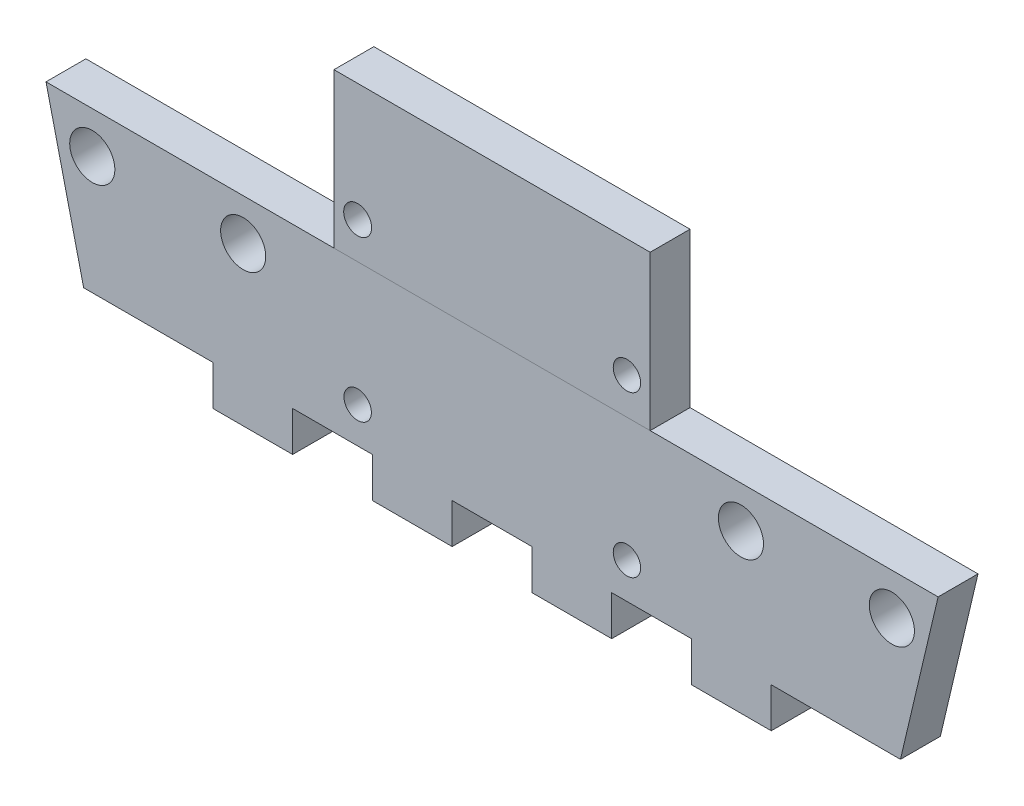
ISO-10303-21;
HEADER;
FILE_DESCRIPTION(('STEP AP214'),'2;1');
FILE_NAME('part.step','',(''),(''),'','','');
FILE_SCHEMA(('AUTOMOTIVE_DESIGN { 1 0 10303 214 1 1 1 1 }'));
ENDSEC;
DATA;
#1=APPLICATION_CONTEXT('core data for automotive mechanical design processes');
#2=APPLICATION_PROTOCOL_DEFINITION('international standard','automotive_design',2000,#1);
#3=PRODUCT_CONTEXT('',#1,'mechanical');
#4=PRODUCT('Part','Part','',(#3));
#5=PRODUCT_RELATED_PRODUCT_CATEGORY('part','',(#4));
#6=PRODUCT_DEFINITION_FORMATION('','',#4);
#7=PRODUCT_DEFINITION_CONTEXT('part definition',#1,'design');
#8=PRODUCT_DEFINITION('design','',#6,#7);
#9=PRODUCT_DEFINITION_SHAPE('','',#8);
#10=(LENGTH_UNIT() NAMED_UNIT(*) SI_UNIT(.MILLI.,.METRE.));
#11=(NAMED_UNIT(*) PLANE_ANGLE_UNIT() SI_UNIT($,.RADIAN.));
#12=(NAMED_UNIT(*) SI_UNIT($,.STERADIAN.) SOLID_ANGLE_UNIT());
#13=UNCERTAINTY_MEASURE_WITH_UNIT(LENGTH_MEASURE(1.E-05),#10,'distance_accuracy_value','');
#14=(GEOMETRIC_REPRESENTATION_CONTEXT(3) GLOBAL_UNCERTAINTY_ASSIGNED_CONTEXT((#13)) GLOBAL_UNIT_ASSIGNED_CONTEXT((#10,
#11,#12)) REPRESENTATION_CONTEXT('',''));
#15=CARTESIAN_POINT('',(0.,0.,0.));
#16=DIRECTION('',(0.,0.,1.));
#17=DIRECTION('',(1.,0.,0.));
#18=AXIS2_PLACEMENT_3D('',#15,#16,#17);
#19=CARTESIAN_POINT('',(19.9263,12.3,0.));
#20=DIRECTION('',(-1.,0.,0.));
#21=DIRECTION('',(0.,-1.,0.));
#22=AXIS2_PLACEMENT_3D('',#19,#20,#21);
#23=PLANE('',#22);
#24=DIRECTION('',(0.,-1.,0.));
#25=VECTOR('',#24,1.);
#26=CARTESIAN_POINT('',(19.9263,12.3,3.175));
#27=LINE('',#26,#25);
#28=CARTESIAN_POINT('',(19.9263,12.3,3.175));
#29=VERTEX_POINT('',#28);
#30=CARTESIAN_POINT('',(19.9263,0.,3.175));
#31=VERTEX_POINT('',#30);
#32=EDGE_CURVE('E217',#29,#31,#27,.T.);
#33=ORIENTED_EDGE('',*,*,#32,.F.);
#34=DIRECTION('',(0.,0.,1.));
#35=VECTOR('',#34,1.);
#36=CARTESIAN_POINT('',(19.9263,12.3,0.));
#37=LINE('',#36,#35);
#38=CARTESIAN_POINT('',(19.9263,12.3,0.));
#39=VERTEX_POINT('',#38);
#40=EDGE_CURVE('E13',#39,#29,#37,.T.);
#41=ORIENTED_EDGE('',*,*,#40,.F.);
#42=DIRECTION('',(0.,-1.,0.));
#43=VECTOR('',#42,1.);
#44=CARTESIAN_POINT('',(19.9263,12.3,0.));
#45=LINE('',#44,#43);
#46=CARTESIAN_POINT('',(19.9263,0.,0.));
#47=VERTEX_POINT('',#46);
#48=EDGE_CURVE('E210',#39,#47,#45,.T.);
#49=ORIENTED_EDGE('',*,*,#48,.T.);
#50=DIRECTION('',(0.,0.,1.));
#51=VECTOR('',#50,1.);
#52=CARTESIAN_POINT('',(19.9263,0.,0.));
#53=LINE('',#52,#51);
#54=EDGE_CURVE('E155',#47,#31,#53,.T.);
#55=ORIENTED_EDGE('',*,*,#54,.T.);
#56=EDGE_LOOP('',(#33,#41,#49,#55));
#57=FACE_BOUND('',#56,.T.);
#58=ADVANCED_FACE('F152',(#57),#23,.T.);
#59=CARTESIAN_POINT('',(19.9263,12.3,0.));
#60=DIRECTION('',(0.,1.,0.));
#61=DIRECTION('',(-1.,0.,0.));
#62=AXIS2_PLACEMENT_3D('',#59,#60,#61);
#63=PLANE('',#62);
#64=DIRECTION('',(-1.,0.,0.));
#65=VECTOR('',#64,1.);
#66=CARTESIAN_POINT('',(19.9263,12.3,3.175));
#67=LINE('',#66,#65);
#68=CARTESIAN_POINT('',(45.0977,12.3,3.175));
#69=VERTEX_POINT('',#68);
#70=EDGE_CURVE('E212',#69,#29,#67,.T.);
#71=ORIENTED_EDGE('',*,*,#70,.F.);
#72=DIRECTION('',(0.,0.,1.));
#73=VECTOR('',#72,1.);
#74=CARTESIAN_POINT('',(45.0977,12.3,0.));
#75=LINE('',#74,#73);
#76=CARTESIAN_POINT('',(45.0977,12.3,0.));
#77=VERTEX_POINT('',#76);
#78=EDGE_CURVE('E161',#77,#69,#75,.T.);
#79=ORIENTED_EDGE('',*,*,#78,.F.);
#80=DIRECTION('',(-1.,0.,0.));
#81=VECTOR('',#80,1.);
#82=CARTESIAN_POINT('',(19.9263,12.3,0.));
#83=LINE('',#82,#81);
#84=EDGE_CURVE('E207',#77,#39,#83,.T.);
#85=ORIENTED_EDGE('',*,*,#84,.T.);
#86=ORIENTED_EDGE('',*,*,#40,.T.);
#87=EDGE_LOOP('',(#71,#79,#85,#86));
#88=FACE_BOUND('',#87,.T.);
#89=ADVANCED_FACE('F228',(#88),#63,.T.);
#90=CARTESIAN_POINT('',(45.0977,12.3,0.));
#91=DIRECTION('',(1.,0.,0.));
#92=DIRECTION('',(0.,1.,0.));
#93=AXIS2_PLACEMENT_3D('',#90,#91,#92);
#94=PLANE('',#93);
#95=DIRECTION('',(0.,1.,0.));
#96=VECTOR('',#95,1.);
#97=CARTESIAN_POINT('',(45.0977,12.3,3.175));
#98=LINE('',#97,#96);
#99=CARTESIAN_POINT('',(45.0977,0.,3.175));
#100=VERTEX_POINT('',#99);
#101=EDGE_CURVE('E202',#100,#69,#98,.T.);
#102=ORIENTED_EDGE('',*,*,#101,.F.);
#103=DIRECTION('',(0.,0.,1.));
#104=VECTOR('',#103,1.);
#105=CARTESIAN_POINT('',(45.0977,0.,0.));
#106=LINE('',#105,#104);
#107=CARTESIAN_POINT('',(45.0977,0.,0.));
#108=VERTEX_POINT('',#107);
#109=EDGE_CURVE('E197',#108,#100,#106,.T.);
#110=ORIENTED_EDGE('',*,*,#109,.F.);
#111=DIRECTION('',(0.,1.,0.));
#112=VECTOR('',#111,1.);
#113=CARTESIAN_POINT('',(45.0977,12.3,0.));
#114=LINE('',#113,#112);
#115=EDGE_CURVE('E200',#108,#77,#114,.T.);
#116=ORIENTED_EDGE('',*,*,#115,.T.);
#117=ORIENTED_EDGE('',*,*,#78,.T.);
#118=EDGE_LOOP('',(#102,#110,#116,#117));
#119=FACE_BOUND('',#118,.T.);
#120=ADVANCED_FACE('F199',(#119),#94,.T.);
#121=CARTESIAN_POINT('',(19.9263,0.,0.));
#122=DIRECTION('',(0.,-1.,0.));
#123=DIRECTION('',(1.,0.,0.));
#124=AXIS2_PLACEMENT_3D('',#121,#122,#123);
#125=PLANE('',#124);
#126=DIRECTION('',(1.,0.,0.));
#127=VECTOR('',#126,1.);
#128=CARTESIAN_POINT('',(19.9263,0.,3.175));
#129=LINE('',#128,#127);
#130=EDGE_CURVE('E220',#31,#100,#129,.T.);
#131=ORIENTED_EDGE('',*,*,#130,.F.);
#132=ORIENTED_EDGE('',*,*,#54,.F.);
#133=DIRECTION('',(1.,0.,0.));
#134=VECTOR('',#133,1.);
#135=CARTESIAN_POINT('',(19.9263,0.,0.));
#136=LINE('',#135,#134);
#137=EDGE_CURVE('E206',#47,#108,#136,.T.);
#138=ORIENTED_EDGE('',*,*,#137,.T.);
#139=ORIENTED_EDGE('',*,*,#109,.T.);
#140=EDGE_LOOP('',(#131,#132,#138,#139));
#141=FACE_BOUND('',#140,.T.);
#142=ADVANCED_FACE('F209',(#141),#125,.T.);
#143=CARTESIAN_POINT('',(0.,0.,0.));
#144=DIRECTION('',(0.,0.,1.));
#145=DIRECTION('',(1.,0.,0.));
#146=AXIS2_PLACEMENT_3D('',#143,#144,#145);
#147=PLANE('',#146);
#148=CARTESIAN_POINT('',(43.2505698195967,2.902,0.));
#149=DIRECTION('',(0.,0.,-1.));
#150=DIRECTION('',(-1.,0.,0.));
#151=AXIS2_PLACEMENT_3D('',#148,#149,#150);
#152=CIRCLE('',#151,1.0922);
#153=CARTESIAN_POINT('',(42.1583698195967,2.902,0.));
#154=VERTEX_POINT('',#153);
#155=EDGE_CURVE('E263',#154,#154,#152,.T.);
#156=ORIENTED_EDGE('',*,*,#155,.F.);
#157=EDGE_LOOP('',(#156));
#158=FACE_BOUND('',#157,.T.);
#159=CARTESIAN_POINT('',(21.8129698195967,2.902,0.));
#160=DIRECTION('',(0.,0.,-1.));
#161=DIRECTION('',(-1.,0.,0.));
#162=AXIS2_PLACEMENT_3D('',#159,#160,#161);
#163=CIRCLE('',#162,1.11207650638862);
#164=CARTESIAN_POINT('',(20.7008933132081,2.902,0.));
#165=VERTEX_POINT('',#164);
#166=EDGE_CURVE('E268',#165,#165,#163,.T.);
#167=ORIENTED_EDGE('',*,*,#166,.F.);
#168=EDGE_LOOP('',(#167));
#169=FACE_BOUND('',#168,.T.);
#170=ORIENTED_EDGE('',*,*,#48,.F.);
#171=ORIENTED_EDGE('',*,*,#84,.F.);
#172=ORIENTED_EDGE('',*,*,#115,.F.);
#173=ORIENTED_EDGE('',*,*,#137,.F.);
#174=EDGE_LOOP('',(#170,#171,#172,#173));
#175=FACE_BOUND('',#174,.T.);
#176=ADVANCED_FACE('F205',(#158,#169,#175),#147,.F.);
#177=CARTESIAN_POINT('',(0.,0.,3.175));
#178=DIRECTION('',(0.,0.,1.));
#179=DIRECTION('',(1.,0.,0.));
#180=AXIS2_PLACEMENT_3D('',#177,#178,#179);
#181=PLANE('',#180);
#182=CARTESIAN_POINT('',(43.2505698195967,2.902,3.175));
#183=DIRECTION('',(0.,0.,-1.));
#184=DIRECTION('',(-1.,0.,0.));
#185=AXIS2_PLACEMENT_3D('',#182,#183,#184);
#186=CIRCLE('',#185,1.0922);
#187=CARTESIAN_POINT('',(42.1583698195967,2.902,3.175));
#188=VERTEX_POINT('',#187);
#189=EDGE_CURVE('E221',#188,#188,#186,.T.);
#190=ORIENTED_EDGE('',*,*,#189,.T.);
#191=EDGE_LOOP('',(#190));
#192=FACE_BOUND('',#191,.T.);
#193=CARTESIAN_POINT('',(21.8129698195967,2.902,3.175));
#194=DIRECTION('',(0.,0.,-1.));
#195=DIRECTION('',(-1.,0.,0.));
#196=AXIS2_PLACEMENT_3D('',#193,#194,#195);
#197=CIRCLE('',#196,1.11207650638862);
#198=CARTESIAN_POINT('',(20.7008933132081,2.902,3.175));
#199=VERTEX_POINT('',#198);
#200=EDGE_CURVE('E264',#199,#199,#197,.T.);
#201=ORIENTED_EDGE('',*,*,#200,.T.);
#202=EDGE_LOOP('',(#201));
#203=FACE_BOUND('',#202,.T.);
#204=ORIENTED_EDGE('',*,*,#32,.T.);
#205=ORIENTED_EDGE('',*,*,#130,.T.);
#206=ORIENTED_EDGE('',*,*,#101,.T.);
#207=ORIENTED_EDGE('',*,*,#70,.T.);
#208=EDGE_LOOP('',(#204,#205,#206,#207));
#209=FACE_BOUND('',#208,.T.);
#210=ADVANCED_FACE('F227',(#192,#203,#209),#181,.T.);
#211=CARTESIAN_POINT('',(21.8129698195967,2.902,3.175));
#212=DIRECTION('',(0.,0.,-1.));
#213=DIRECTION('',(-1.,0.,0.));
#214=AXIS2_PLACEMENT_3D('',#211,#212,#213);
#215=CYLINDRICAL_SURFACE('',#214,1.11207650638862);
#216=ORIENTED_EDGE('',*,*,#200,.F.);
#217=EDGE_LOOP('',(#216));
#218=FACE_BOUND('',#217,.T.);
#219=ORIENTED_EDGE('',*,*,#166,.T.);
#220=EDGE_LOOP('',(#219));
#221=FACE_BOUND('',#220,.T.);
#222=ADVANCED_FACE('F246',(#218,#221),#215,.F.);
#223=CARTESIAN_POINT('',(43.2505698195967,2.902,3.175));
#224=DIRECTION('',(0.,0.,-1.));
#225=DIRECTION('',(-1.,0.,0.));
#226=AXIS2_PLACEMENT_3D('',#223,#224,#225);
#227=CYLINDRICAL_SURFACE('',#226,1.0922);
#228=ORIENTED_EDGE('',*,*,#189,.F.);
#229=EDGE_LOOP('',(#228));
#230=FACE_BOUND('',#229,.T.);
#231=ORIENTED_EDGE('',*,*,#155,.T.);
#232=EDGE_LOOP('',(#231));
#233=FACE_BOUND('',#232,.T.);
#234=ADVANCED_FACE('F253',(#230,#233),#227,.F.);
#235=CLOSED_SHELL('',(#58,#89,#120,#142,#176,#210,#222,#234));
#236=MANIFOLD_SOLID_BREP('B2',#235);
#237=CARTESIAN_POINT('',(64.4325639199163,-15.2060850851003,3.175));
#238=DIRECTION('',(-0.973263781284483,0.229690252383138,0.));
#239=DIRECTION('',(-0.229690252383138,-0.973263781284483,0.));
#240=AXIS2_PLACEMENT_3D('',#237,#238,#239);
#241=PLANE('',#240);
#242=DIRECTION('',(0.229690252383138,0.973263781284483,0.));
#243=VECTOR('',#242,1.);
#244=CARTESIAN_POINT('',(64.4325639199163,-15.2060850851003,0.));
#245=LINE('',#244,#243);
#246=CARTESIAN_POINT('',(65.024,-12.7,0.));
#247=VERTEX_POINT('',#246);
#248=CARTESIAN_POINT('',(68.0212,0.,0.));
#249=VERTEX_POINT('',#248);
#250=EDGE_CURVE('E485',#247,#249,#245,.T.);
#251=ORIENTED_EDGE('',*,*,#250,.T.);
#252=DIRECTION('',(0.,0.,-1.));
#253=VECTOR('',#252,1.);
#254=CARTESIAN_POINT('',(68.0212,0.,3.175));
#255=LINE('',#254,#253);
#256=CARTESIAN_POINT('',(68.0212,0.,3.175));
#257=VERTEX_POINT('',#256);
#258=EDGE_CURVE('E326',#257,#249,#255,.T.);
#259=ORIENTED_EDGE('',*,*,#258,.F.);
#260=DIRECTION('',(0.229690252383138,0.973263781284483,0.));
#261=VECTOR('',#260,1.);
#262=CARTESIAN_POINT('',(64.4325639199163,-15.2060850851003,3.175));
#263=LINE('',#262,#261);
#264=CARTESIAN_POINT('',(65.024,-12.7,3.175));
#265=VERTEX_POINT('',#264);
#266=EDGE_CURVE('E670',#265,#257,#263,.T.);
#267=ORIENTED_EDGE('',*,*,#266,.F.);
#268=DIRECTION('',(0.,0.,-1.));
#269=VECTOR('',#268,1.);
#270=CARTESIAN_POINT('',(65.024,-12.7,3.175));
#271=LINE('',#270,#269);
#272=EDGE_CURVE('E150',#265,#247,#271,.T.);
#273=ORIENTED_EDGE('',*,*,#272,.T.);
#274=EDGE_LOOP('',(#251,#259,#267,#273));
#275=FACE_BOUND('',#274,.T.);
#276=ADVANCED_FACE('F318',(#275),#241,.F.);
#277=CARTESIAN_POINT('',(0.,0.,3.175));
#278=DIRECTION('',(0.,1.,0.));
#279=DIRECTION('',(0.,0.,1.));
#280=AXIS2_PLACEMENT_3D('',#277,#278,#279);
#281=PLANE('',#280);
#282=DIRECTION('',(0.,0.,-1.));
#283=VECTOR('',#282,1.);
#284=CARTESIAN_POINT('',(-2.9972,0.,3.175));
#285=LINE('',#284,#283);
#286=CARTESIAN_POINT('',(-2.9972,0.,3.175));
#287=VERTEX_POINT('',#286);
#288=CARTESIAN_POINT('',(-2.9972,0.,0.));
#289=VERTEX_POINT('',#288);
#290=EDGE_CURVE('E561',#287,#289,#285,.T.);
#291=ORIENTED_EDGE('',*,*,#290,.F.);
#292=DIRECTION('',(1.,0.,0.));
#293=VECTOR('',#292,1.);
#294=CARTESIAN_POINT('',(0.,0.,3.175));
#295=LINE('',#294,#293);
#296=EDGE_CURVE('E568',#287,#257,#295,.T.);
#297=ORIENTED_EDGE('',*,*,#296,.T.);
#298=ORIENTED_EDGE('',*,*,#258,.T.);
#299=DIRECTION('',(1.,0.,0.));
#300=VECTOR('',#299,1.);
#301=CARTESIAN_POINT('',(0.,0.,0.));
#302=LINE('',#301,#300);
#303=EDGE_CURVE('E491',#289,#249,#302,.T.);
#304=ORIENTED_EDGE('',*,*,#303,.F.);
#305=EDGE_LOOP('',(#291,#297,#298,#304));
#306=FACE_BOUND('',#305,.T.);
#307=ADVANCED_FACE('F567',(#306),#281,.T.);
#308=CARTESIAN_POINT('',(-2.83907488519422,-0.670021672905836,3.175));
#309=DIRECTION('',(-0.973263781284483,-0.229690252383138,0.));
#310=DIRECTION('',(0.229690252383138,-0.973263781284483,0.));
#311=AXIS2_PLACEMENT_3D('',#308,#309,#310);
#312=PLANE('',#311);
#313=DIRECTION('',(-0.229690252383138,0.973263781284483,0.));
#314=VECTOR('',#313,1.);
#315=CARTESIAN_POINT('',(-2.83907488519422,-0.670021672905836,0.));
#316=LINE('',#315,#314);
#317=CARTESIAN_POINT('',(0.,-12.7,0.));
#318=VERTEX_POINT('',#317);
#319=EDGE_CURVE('E493',#318,#289,#316,.T.);
#320=ORIENTED_EDGE('',*,*,#319,.F.);
#321=DIRECTION('',(0.,0.,-1.));
#322=VECTOR('',#321,1.);
#323=CARTESIAN_POINT('',(0.,-12.7,3.175));
#324=LINE('',#323,#322);
#325=CARTESIAN_POINT('',(0.,-12.7,3.175));
#326=VERTEX_POINT('',#325);
#327=EDGE_CURVE('E559',#326,#318,#324,.T.);
#328=ORIENTED_EDGE('',*,*,#327,.F.);
#329=DIRECTION('',(-0.229690252383138,0.973263781284483,0.));
#330=VECTOR('',#329,1.);
#331=CARTESIAN_POINT('',(-2.83907488519422,-0.670021672905836,3.175));
#332=LINE('',#331,#330);
#333=EDGE_CURVE('E665',#326,#287,#332,.T.);
#334=ORIENTED_EDGE('',*,*,#333,.T.);
#335=ORIENTED_EDGE('',*,*,#290,.T.);
#336=EDGE_LOOP('',(#320,#328,#334,#335));
#337=FACE_BOUND('',#336,.T.);
#338=ADVANCED_FACE('F592',(#337),#312,.T.);
#339=CARTESIAN_POINT('',(0.,-12.7,3.175));
#340=DIRECTION('',(0.,-1.,0.));
#341=DIRECTION('',(1.,0.,0.));
#342=AXIS2_PLACEMENT_3D('',#339,#340,#341);
#343=PLANE('',#342);
#344=DIRECTION('',(-1.,0.,0.));
#345=VECTOR('',#344,1.);
#346=CARTESIAN_POINT('',(0.,-12.7,0.));
#347=LINE('',#346,#345);
#348=CARTESIAN_POINT('',(10.287,-12.7,0.));
#349=VERTEX_POINT('',#348);
#350=EDGE_CURVE('E488',#349,#318,#347,.T.);
#351=ORIENTED_EDGE('',*,*,#350,.F.);
#352=DIRECTION('',(0.,0.,-1.));
#353=VECTOR('',#352,1.);
#354=CARTESIAN_POINT('',(10.287,-12.7,3.175));
#355=LINE('',#354,#353);
#356=CARTESIAN_POINT('',(10.287,-12.7,3.175));
#357=VERTEX_POINT('',#356);
#358=EDGE_CURVE('E557',#357,#349,#355,.T.);
#359=ORIENTED_EDGE('',*,*,#358,.F.);
#360=DIRECTION('',(-1.,0.,0.));
#361=VECTOR('',#360,1.);
#362=CARTESIAN_POINT('',(0.,-12.7,3.175));
#363=LINE('',#362,#361);
#364=EDGE_CURVE('E662',#357,#326,#363,.T.);
#365=ORIENTED_EDGE('',*,*,#364,.T.);
#366=ORIENTED_EDGE('',*,*,#327,.T.);
#367=EDGE_LOOP('',(#351,#359,#365,#366));
#368=FACE_BOUND('',#367,.T.);
#369=ADVANCED_FACE('F578',(#368),#343,.T.);
#370=CARTESIAN_POINT('',(10.287,0.,3.175));
#371=DIRECTION('',(1.,0.,0.));
#372=DIRECTION('',(0.,0.,-1.));
#373=AXIS2_PLACEMENT_3D('',#370,#371,#372);
#374=PLANE('',#373);
#375=DIRECTION('',(0.,-1.,0.));
#376=VECTOR('',#375,1.);
#377=CARTESIAN_POINT('',(10.287,0.,0.));
#378=LINE('',#377,#376);
#379=CARTESIAN_POINT('',(10.287,-15.875,0.));
#380=VERTEX_POINT('',#379);
#381=EDGE_CURVE('E496',#349,#380,#378,.T.);
#382=ORIENTED_EDGE('',*,*,#381,.T.);
#383=DIRECTION('',(0.,0.,-1.));
#384=VECTOR('',#383,1.);
#385=CARTESIAN_POINT('',(10.287,-15.875,3.175));
#386=LINE('',#385,#384);
#387=CARTESIAN_POINT('',(10.287,-15.875,3.175));
#388=VERTEX_POINT('',#387);
#389=EDGE_CURVE('E555',#388,#380,#386,.T.);
#390=ORIENTED_EDGE('',*,*,#389,.F.);
#391=DIRECTION('',(0.,-1.,0.));
#392=VECTOR('',#391,1.);
#393=CARTESIAN_POINT('',(10.287,0.,3.175));
#394=LINE('',#393,#392);
#395=EDGE_CURVE('E667',#357,#388,#394,.T.);
#396=ORIENTED_EDGE('',*,*,#395,.F.);
#397=ORIENTED_EDGE('',*,*,#358,.T.);
#398=EDGE_LOOP('',(#382,#390,#396,#397));
#399=FACE_BOUND('',#398,.T.);
#400=ADVANCED_FACE('F591',(#399),#374,.F.);
#401=CARTESIAN_POINT('',(0.,-15.875,3.175));
#402=DIRECTION('',(0.,-1.,0.));
#403=DIRECTION('',(1.,0.,0.));
#404=AXIS2_PLACEMENT_3D('',#401,#402,#403);
#405=PLANE('',#404);
#406=DIRECTION('',(-1.,0.,0.));
#407=VECTOR('',#406,1.);
#408=CARTESIAN_POINT('',(0.,-15.875,0.));
#409=LINE('',#408,#407);
#410=CARTESIAN_POINT('',(16.637,-15.875,0.));
#411=VERTEX_POINT('',#410);
#412=EDGE_CURVE('E499',#411,#380,#409,.T.);
#413=ORIENTED_EDGE('',*,*,#412,.F.);
#414=DIRECTION('',(0.,0.,-1.));
#415=VECTOR('',#414,1.);
#416=CARTESIAN_POINT('',(16.637,-15.875,3.175));
#417=LINE('',#416,#415);
#418=CARTESIAN_POINT('',(16.637,-15.875,3.175));
#419=VERTEX_POINT('',#418);
#420=EDGE_CURVE('E553',#419,#411,#417,.T.);
#421=ORIENTED_EDGE('',*,*,#420,.F.);
#422=DIRECTION('',(-1.,0.,0.));
#423=VECTOR('',#422,1.);
#424=CARTESIAN_POINT('',(0.,-15.875,3.175));
#425=LINE('',#424,#423);
#426=EDGE_CURVE('E675',#419,#388,#425,.T.);
#427=ORIENTED_EDGE('',*,*,#426,.T.);
#428=ORIENTED_EDGE('',*,*,#389,.T.);
#429=EDGE_LOOP('',(#413,#421,#427,#428));
#430=FACE_BOUND('',#429,.T.);
#431=ADVANCED_FACE('F611',(#430),#405,.T.);
#432=CARTESIAN_POINT('',(16.637,0.,3.175));
#433=DIRECTION('',(1.,0.,0.));
#434=DIRECTION('',(0.,0.,-1.));
#435=AXIS2_PLACEMENT_3D('',#432,#433,#434);
#436=PLANE('',#435);
#437=DIRECTION('',(0.,-1.,0.));
#438=VECTOR('',#437,1.);
#439=CARTESIAN_POINT('',(16.637,0.,0.));
#440=LINE('',#439,#438);
#441=CARTESIAN_POINT('',(16.637,-12.7,0.));
#442=VERTEX_POINT('',#441);
#443=EDGE_CURVE('E502',#442,#411,#440,.T.);
#444=ORIENTED_EDGE('',*,*,#443,.F.);
#445=DIRECTION('',(0.,0.,-1.));
#446=VECTOR('',#445,1.);
#447=CARTESIAN_POINT('',(16.637,-12.7,3.175));
#448=LINE('',#447,#446);
#449=CARTESIAN_POINT('',(16.637,-12.7,3.175));
#450=VERTEX_POINT('',#449);
#451=EDGE_CURVE('E551',#450,#442,#448,.T.);
#452=ORIENTED_EDGE('',*,*,#451,.F.);
#453=DIRECTION('',(0.,-1.,0.));
#454=VECTOR('',#453,1.);
#455=CARTESIAN_POINT('',(16.637,0.,3.175));
#456=LINE('',#455,#454);
#457=EDGE_CURVE('E678',#450,#419,#456,.T.);
#458=ORIENTED_EDGE('',*,*,#457,.T.);
#459=ORIENTED_EDGE('',*,*,#420,.T.);
#460=EDGE_LOOP('',(#444,#452,#458,#459));
#461=FACE_BOUND('',#460,.T.);
#462=ADVANCED_FACE('F615',(#461),#436,.T.);
#463=CARTESIAN_POINT('',(22.987,-12.7,0.));
#464=VERTEX_POINT('',#463);
#465=EDGE_CURVE('E505',#464,#442,#347,.T.);
#466=ORIENTED_EDGE('',*,*,#465,.F.);
#467=DIRECTION('',(0.,0.,-1.));
#468=VECTOR('',#467,1.);
#469=CARTESIAN_POINT('',(22.987,-12.7,3.175));
#470=LINE('',#469,#468);
#471=CARTESIAN_POINT('',(22.987,-12.7,3.175));
#472=VERTEX_POINT('',#471);
#473=EDGE_CURVE('E549',#472,#464,#470,.T.);
#474=ORIENTED_EDGE('',*,*,#473,.F.);
#475=EDGE_CURVE('E669',#472,#450,#363,.T.);
#476=ORIENTED_EDGE('',*,*,#475,.T.);
#477=ORIENTED_EDGE('',*,*,#451,.T.);
#478=EDGE_LOOP('',(#466,#474,#476,#477));
#479=FACE_BOUND('',#478,.T.);
#480=ADVANCED_FACE('F594',(#479),#343,.T.);
#481=CARTESIAN_POINT('',(22.987,0.,3.175));
#482=DIRECTION('',(1.,0.,0.));
#483=DIRECTION('',(0.,1.,0.));
#484=AXIS2_PLACEMENT_3D('',#481,#482,#483);
#485=PLANE('',#484);
#486=DIRECTION('',(0.,-1.,0.));
#487=VECTOR('',#486,1.);
#488=CARTESIAN_POINT('',(22.987,0.,0.));
#489=LINE('',#488,#487);
#490=CARTESIAN_POINT('',(22.987,-15.875,0.));
#491=VERTEX_POINT('',#490);
#492=EDGE_CURVE('E506',#464,#491,#489,.T.);
#493=ORIENTED_EDGE('',*,*,#492,.T.);
#494=DIRECTION('',(0.,0.,-1.));
#495=VECTOR('',#494,1.);
#496=CARTESIAN_POINT('',(22.987,-15.875,3.175));
#497=LINE('',#496,#495);
#498=CARTESIAN_POINT('',(22.987,-15.875,3.175));
#499=VERTEX_POINT('',#498);
#500=EDGE_CURVE('E547',#499,#491,#497,.T.);
#501=ORIENTED_EDGE('',*,*,#500,.F.);
#502=DIRECTION('',(0.,-1.,0.));
#503=VECTOR('',#502,1.);
#504=CARTESIAN_POINT('',(22.987,0.,3.175));
#505=LINE('',#504,#503);
#506=EDGE_CURVE('E681',#472,#499,#505,.T.);
#507=ORIENTED_EDGE('',*,*,#506,.F.);
#508=ORIENTED_EDGE('',*,*,#473,.T.);
#509=EDGE_LOOP('',(#493,#501,#507,#508));
#510=FACE_BOUND('',#509,.T.);
#511=ADVANCED_FACE('F620',(#510),#485,.F.);
#512=CARTESIAN_POINT('',(0.,-15.875,3.175));
#513=DIRECTION('',(0.,-1.,0.));
#514=DIRECTION('',(1.,0.,0.));
#515=AXIS2_PLACEMENT_3D('',#512,#513,#514);
#516=PLANE('',#515);
#517=DIRECTION('',(-1.,0.,0.));
#518=VECTOR('',#517,1.);
#519=CARTESIAN_POINT('',(0.,-15.875,0.));
#520=LINE('',#519,#518);
#521=CARTESIAN_POINT('',(29.337,-15.875,0.));
#522=VERTEX_POINT('',#521);
#523=EDGE_CURVE('E509',#522,#491,#520,.T.);
#524=ORIENTED_EDGE('',*,*,#523,.F.);
#525=DIRECTION('',(0.,0.,-1.));
#526=VECTOR('',#525,1.);
#527=CARTESIAN_POINT('',(29.337,-15.875,3.175));
#528=LINE('',#527,#526);
#529=CARTESIAN_POINT('',(29.337,-15.875,3.175));
#530=VERTEX_POINT('',#529);
#531=EDGE_CURVE('E545',#530,#522,#528,.T.);
#532=ORIENTED_EDGE('',*,*,#531,.F.);
#533=DIRECTION('',(-1.,0.,0.));
#534=VECTOR('',#533,1.);
#535=CARTESIAN_POINT('',(0.,-15.875,3.175));
#536=LINE('',#535,#534);
#537=EDGE_CURVE('E683',#530,#499,#536,.T.);
#538=ORIENTED_EDGE('',*,*,#537,.T.);
#539=ORIENTED_EDGE('',*,*,#500,.T.);
#540=EDGE_LOOP('',(#524,#532,#538,#539));
#541=FACE_BOUND('',#540,.T.);
#542=ADVANCED_FACE('F623',(#541),#516,.T.);
#543=CARTESIAN_POINT('',(29.337,0.,3.175));
#544=DIRECTION('',(1.,0.,0.));
#545=DIRECTION('',(0.,1.,0.));
#546=AXIS2_PLACEMENT_3D('',#543,#544,#545);
#547=PLANE('',#546);
#548=DIRECTION('',(0.,-1.,0.));
#549=VECTOR('',#548,1.);
#550=CARTESIAN_POINT('',(29.337,0.,0.));
#551=LINE('',#550,#549);
#552=CARTESIAN_POINT('',(29.337,-12.7,0.));
#553=VERTEX_POINT('',#552);
#554=EDGE_CURVE('E512',#553,#522,#551,.T.);
#555=ORIENTED_EDGE('',*,*,#554,.F.);
#556=DIRECTION('',(0.,0.,-1.));
#557=VECTOR('',#556,1.);
#558=CARTESIAN_POINT('',(29.337,-12.7,3.175));
#559=LINE('',#558,#557);
#560=CARTESIAN_POINT('',(29.337,-12.7,3.175));
#561=VERTEX_POINT('',#560);
#562=EDGE_CURVE('E543',#561,#553,#559,.T.);
#563=ORIENTED_EDGE('',*,*,#562,.F.);
#564=DIRECTION('',(0.,-1.,0.));
#565=VECTOR('',#564,1.);
#566=CARTESIAN_POINT('',(29.337,0.,3.175));
#567=LINE('',#566,#565);
#568=EDGE_CURVE('E686',#561,#530,#567,.T.);
#569=ORIENTED_EDGE('',*,*,#568,.T.);
#570=ORIENTED_EDGE('',*,*,#531,.T.);
#571=EDGE_LOOP('',(#555,#563,#569,#570));
#572=FACE_BOUND('',#571,.T.);
#573=ADVANCED_FACE('F627',(#572),#547,.T.);
#574=CARTESIAN_POINT('',(35.687,-12.7,0.));
#575=VERTEX_POINT('',#574);
#576=EDGE_CURVE('E515',#575,#553,#347,.T.);
#577=ORIENTED_EDGE('',*,*,#576,.F.);
#578=DIRECTION('',(0.,0.,-1.));
#579=VECTOR('',#578,1.);
#580=CARTESIAN_POINT('',(35.687,-12.7,3.175));
#581=LINE('',#580,#579);
#582=CARTESIAN_POINT('',(35.687,-12.7,3.175));
#583=VERTEX_POINT('',#582);
#584=EDGE_CURVE('E541',#583,#575,#581,.T.);
#585=ORIENTED_EDGE('',*,*,#584,.F.);
#586=EDGE_CURVE('E689',#583,#561,#363,.T.);
#587=ORIENTED_EDGE('',*,*,#586,.T.);
#588=ORIENTED_EDGE('',*,*,#562,.T.);
#589=EDGE_LOOP('',(#577,#585,#587,#588));
#590=FACE_BOUND('',#589,.T.);
#591=ADVANCED_FACE('F598',(#590),#343,.T.);
#592=CARTESIAN_POINT('',(35.687,0.,3.175));
#593=DIRECTION('',(1.,0.,0.));
#594=DIRECTION('',(0.,0.,-1.));
#595=AXIS2_PLACEMENT_3D('',#592,#593,#594);
#596=PLANE('',#595);
#597=DIRECTION('',(0.,-1.,0.));
#598=VECTOR('',#597,1.);
#599=CARTESIAN_POINT('',(35.687,0.,0.));
#600=LINE('',#599,#598);
#601=CARTESIAN_POINT('',(35.687,-15.875,0.));
#602=VERTEX_POINT('',#601);
#603=EDGE_CURVE('E516',#575,#602,#600,.T.);
#604=ORIENTED_EDGE('',*,*,#603,.T.);
#605=DIRECTION('',(0.,0.,-1.));
#606=VECTOR('',#605,1.);
#607=CARTESIAN_POINT('',(35.687,-15.875,3.175));
#608=LINE('',#607,#606);
#609=CARTESIAN_POINT('',(35.687,-15.875,3.175));
#610=VERTEX_POINT('',#609);
#611=EDGE_CURVE('E538',#610,#602,#608,.T.);
#612=ORIENTED_EDGE('',*,*,#611,.F.);
#613=DIRECTION('',(0.,-1.,0.));
#614=VECTOR('',#613,1.);
#615=CARTESIAN_POINT('',(35.687,0.,3.175));
#616=LINE('',#615,#614);
#617=EDGE_CURVE('E690',#583,#610,#616,.T.);
#618=ORIENTED_EDGE('',*,*,#617,.F.);
#619=ORIENTED_EDGE('',*,*,#584,.T.);
#620=EDGE_LOOP('',(#604,#612,#618,#619));
#621=FACE_BOUND('',#620,.T.);
#622=ADVANCED_FACE('F632',(#621),#596,.F.);
#623=CARTESIAN_POINT('',(0.,-15.875,3.175));
#624=DIRECTION('',(0.,1.,0.));
#625=DIRECTION('',(0.,0.,1.));
#626=AXIS2_PLACEMENT_3D('',#623,#624,#625);
#627=PLANE('',#626);
#628=DIRECTION('',(1.,0.,0.));
#629=VECTOR('',#628,1.);
#630=CARTESIAN_POINT('',(0.,-15.875,0.));
#631=LINE('',#630,#629);
#632=CARTESIAN_POINT('',(42.037,-15.875,0.));
#633=VERTEX_POINT('',#632);
#634=EDGE_CURVE('E518',#602,#633,#631,.T.);
#635=ORIENTED_EDGE('',*,*,#634,.T.);
#636=DIRECTION('',(0.,0.,-1.));
#637=VECTOR('',#636,1.);
#638=CARTESIAN_POINT('',(42.037,-15.875,3.175));
#639=LINE('',#638,#637);
#640=CARTESIAN_POINT('',(42.037,-15.875,3.175));
#641=VERTEX_POINT('',#640);
#642=EDGE_CURVE('E536',#641,#633,#639,.T.);
#643=ORIENTED_EDGE('',*,*,#642,.F.);
#644=DIRECTION('',(1.,0.,0.));
#645=VECTOR('',#644,1.);
#646=CARTESIAN_POINT('',(0.,-15.875,3.175));
#647=LINE('',#646,#645);
#648=EDGE_CURVE('E692',#610,#641,#647,.T.);
#649=ORIENTED_EDGE('',*,*,#648,.F.);
#650=ORIENTED_EDGE('',*,*,#611,.T.);
#651=EDGE_LOOP('',(#635,#643,#649,#650));
#652=FACE_BOUND('',#651,.T.);
#653=ADVANCED_FACE('F635',(#652),#627,.F.);
#654=CARTESIAN_POINT('',(42.037,0.,3.175));
#655=DIRECTION('',(1.,0.,0.));
#656=DIRECTION('',(0.,0.,-1.));
#657=AXIS2_PLACEMENT_3D('',#654,#655,#656);
#658=PLANE('',#657);
#659=DIRECTION('',(0.,-1.,0.));
#660=VECTOR('',#659,1.);
#661=CARTESIAN_POINT('',(42.037,0.,0.));
#662=LINE('',#661,#660);
#663=CARTESIAN_POINT('',(42.037,-12.7,0.));
#664=VERTEX_POINT('',#663);
#665=EDGE_CURVE('E521',#664,#633,#662,.T.);
#666=ORIENTED_EDGE('',*,*,#665,.F.);
#667=DIRECTION('',(0.,0.,-1.));
#668=VECTOR('',#667,1.);
#669=CARTESIAN_POINT('',(42.037,-12.7,3.175));
#670=LINE('',#669,#668);
#671=CARTESIAN_POINT('',(42.037,-12.7,3.175));
#672=VERTEX_POINT('',#671);
#673=EDGE_CURVE('E534',#672,#664,#670,.T.);
#674=ORIENTED_EDGE('',*,*,#673,.F.);
#675=DIRECTION('',(0.,-1.,0.));
#676=VECTOR('',#675,1.);
#677=CARTESIAN_POINT('',(42.037,0.,3.175));
#678=LINE('',#677,#676);
#679=EDGE_CURVE('E693',#672,#641,#678,.T.);
#680=ORIENTED_EDGE('',*,*,#679,.T.);
#681=ORIENTED_EDGE('',*,*,#642,.T.);
#682=EDGE_LOOP('',(#666,#674,#680,#681));
#683=FACE_BOUND('',#682,.T.);
#684=ADVANCED_FACE('F596',(#683),#658,.T.);
#685=CARTESIAN_POINT('',(48.387,-12.7,0.));
#686=VERTEX_POINT('',#685);
#687=EDGE_CURVE('E487',#686,#664,#347,.T.);
#688=ORIENTED_EDGE('',*,*,#687,.F.);
#689=DIRECTION('',(0.,0.,-1.));
#690=VECTOR('',#689,1.);
#691=CARTESIAN_POINT('',(48.387,-12.7,3.175));
#692=LINE('',#691,#690);
#693=CARTESIAN_POINT('',(48.387,-12.7,3.175));
#694=VERTEX_POINT('',#693);
#695=EDGE_CURVE('E475',#694,#686,#692,.T.);
#696=ORIENTED_EDGE('',*,*,#695,.F.);
#697=EDGE_CURVE('E465',#694,#672,#363,.T.);
#698=ORIENTED_EDGE('',*,*,#697,.T.);
#699=ORIENTED_EDGE('',*,*,#673,.T.);
#700=EDGE_LOOP('',(#688,#696,#698,#699));
#701=FACE_BOUND('',#700,.T.);
#702=ADVANCED_FACE('F579',(#701),#343,.T.);
#703=CARTESIAN_POINT('',(48.387,0.,3.175));
#704=DIRECTION('',(1.,0.,0.));
#705=DIRECTION('',(0.,0.,-1.));
#706=AXIS2_PLACEMENT_3D('',#703,#704,#705);
#707=PLANE('',#706);
#708=DIRECTION('',(0.,-1.,0.));
#709=VECTOR('',#708,1.);
#710=CARTESIAN_POINT('',(48.387,0.,0.));
#711=LINE('',#710,#709);
#712=CARTESIAN_POINT('',(48.387,-15.875,0.));
#713=VERTEX_POINT('',#712);
#714=EDGE_CURVE('E472',#686,#713,#711,.T.);
#715=ORIENTED_EDGE('',*,*,#714,.T.);
#716=DIRECTION('',(0.,0.,-1.));
#717=VECTOR('',#716,1.);
#718=CARTESIAN_POINT('',(48.387,-15.875,3.175));
#719=LINE('',#718,#717);
#720=CARTESIAN_POINT('',(48.387,-15.875,3.175));
#721=VERTEX_POINT('',#720);
#722=EDGE_CURVE('E469',#721,#713,#719,.T.);
#723=ORIENTED_EDGE('',*,*,#722,.F.);
#724=DIRECTION('',(0.,-1.,0.));
#725=VECTOR('',#724,1.);
#726=CARTESIAN_POINT('',(48.387,0.,3.175));
#727=LINE('',#726,#725);
#728=EDGE_CURVE('E457',#694,#721,#727,.T.);
#729=ORIENTED_EDGE('',*,*,#728,.F.);
#730=ORIENTED_EDGE('',*,*,#695,.T.);
#731=EDGE_LOOP('',(#715,#723,#729,#730));
#732=FACE_BOUND('',#731,.T.);
#733=ADVANCED_FACE('F470',(#732),#707,.F.);
#734=CARTESIAN_POINT('',(0.,-15.875,3.175));
#735=DIRECTION('',(0.,1.,0.));
#736=DIRECTION('',(-1.,0.,0.));
#737=AXIS2_PLACEMENT_3D('',#734,#735,#736);
#738=PLANE('',#737);
#739=DIRECTION('',(1.,0.,0.));
#740=VECTOR('',#739,1.);
#741=CARTESIAN_POINT('',(0.,-15.875,0.));
#742=LINE('',#741,#740);
#743=CARTESIAN_POINT('',(54.737,-15.875,0.));
#744=VERTEX_POINT('',#743);
#745=EDGE_CURVE('E525',#713,#744,#742,.T.);
#746=ORIENTED_EDGE('',*,*,#745,.T.);
#747=DIRECTION('',(0.,0.,-1.));
#748=VECTOR('',#747,1.);
#749=CARTESIAN_POINT('',(54.737,-15.875,3.175));
#750=LINE('',#749,#748);
#751=CARTESIAN_POINT('',(54.737,-15.875,3.175));
#752=VERTEX_POINT('',#751);
#753=EDGE_CURVE('E396',#752,#744,#750,.T.);
#754=ORIENTED_EDGE('',*,*,#753,.F.);
#755=DIRECTION('',(1.,0.,0.));
#756=VECTOR('',#755,1.);
#757=CARTESIAN_POINT('',(0.,-15.875,3.175));
#758=LINE('',#757,#756);
#759=EDGE_CURVE('E462',#721,#752,#758,.T.);
#760=ORIENTED_EDGE('',*,*,#759,.F.);
#761=ORIENTED_EDGE('',*,*,#722,.T.);
#762=EDGE_LOOP('',(#746,#754,#760,#761));
#763=FACE_BOUND('',#762,.T.);
#764=ADVANCED_FACE('F477',(#763),#738,.F.);
#765=CARTESIAN_POINT('',(54.737,0.,3.175));
#766=DIRECTION('',(1.,0.,0.));
#767=DIRECTION('',(0.,0.,-1.));
#768=AXIS2_PLACEMENT_3D('',#765,#766,#767);
#769=PLANE('',#768);
#770=DIRECTION('',(0.,-1.,0.));
#771=VECTOR('',#770,1.);
#772=CARTESIAN_POINT('',(54.737,0.,0.));
#773=LINE('',#772,#771);
#774=CARTESIAN_POINT('',(54.737,-12.7,0.));
#775=VERTEX_POINT('',#774);
#776=EDGE_CURVE('E527',#775,#744,#773,.T.);
#777=ORIENTED_EDGE('',*,*,#776,.F.);
#778=DIRECTION('',(0.,0.,-1.));
#779=VECTOR('',#778,1.);
#780=CARTESIAN_POINT('',(54.737,-12.7,3.175));
#781=LINE('',#780,#779);
#782=CARTESIAN_POINT('',(54.737,-12.7,3.175));
#783=VERTEX_POINT('',#782);
#784=EDGE_CURVE('E334',#783,#775,#781,.T.);
#785=ORIENTED_EDGE('',*,*,#784,.F.);
#786=DIRECTION('',(0.,-1.,0.));
#787=VECTOR('',#786,1.);
#788=CARTESIAN_POINT('',(54.737,0.,3.175));
#789=LINE('',#788,#787);
#790=EDGE_CURVE('E478',#783,#752,#789,.T.);
#791=ORIENTED_EDGE('',*,*,#790,.T.);
#792=ORIENTED_EDGE('',*,*,#753,.T.);
#793=EDGE_LOOP('',(#777,#785,#791,#792));
#794=FACE_BOUND('',#793,.T.);
#795=ADVANCED_FACE('F576',(#794),#769,.T.);
#796=EDGE_CURVE('E483',#247,#775,#347,.T.);
#797=ORIENTED_EDGE('',*,*,#796,.F.);
#798=ORIENTED_EDGE('',*,*,#272,.F.);
#799=EDGE_CURVE('E530',#265,#783,#363,.T.);
#800=ORIENTED_EDGE('',*,*,#799,.T.);
#801=ORIENTED_EDGE('',*,*,#784,.T.);
#802=EDGE_LOOP('',(#797,#798,#800,#801));
#803=FACE_BOUND('',#802,.T.);
#804=ADVANCED_FACE('F574',(#803),#343,.T.);
#805=CARTESIAN_POINT('',(0.,0.,0.));
#806=DIRECTION('',(0.,0.,1.));
#807=DIRECTION('',(1.,0.,0.));
#808=AXIS2_PLACEMENT_3D('',#805,#806,#807);
#809=PLANE('',#808);
#810=CARTESIAN_POINT('',(0.685800000000002,-3.302,0.));
#811=DIRECTION('',(0.,0.,-1.));
#812=DIRECTION('',(-1.,0.,0.));
#813=AXIS2_PLACEMENT_3D('',#810,#811,#812);
#814=CIRCLE('',#813,1.79705);
#815=CARTESIAN_POINT('',(-1.11125,-3.302,0.));
#816=VERTEX_POINT('',#815);
#817=EDGE_CURVE('E879',#816,#816,#814,.T.);
#818=ORIENTED_EDGE('',*,*,#817,.F.);
#819=EDGE_LOOP('',(#818));
#820=FACE_BOUND('',#819,.T.);
#821=CARTESIAN_POINT('',(12.7,-3.302,0.));
#822=DIRECTION('',(0.,0.,-1.));
#823=DIRECTION('',(-1.,0.,0.));
#824=AXIS2_PLACEMENT_3D('',#821,#822,#823);
#825=CIRCLE('',#824,1.79705);
#826=CARTESIAN_POINT('',(10.90295,-3.302,0.));
#827=VERTEX_POINT('',#826);
#828=EDGE_CURVE('E881',#827,#827,#825,.T.);
#829=ORIENTED_EDGE('',*,*,#828,.F.);
#830=EDGE_LOOP('',(#829));
#831=FACE_BOUND('',#830,.T.);
#832=CARTESIAN_POINT('',(52.324,-3.30200000000004,0.));
#833=DIRECTION('',(0.,0.,-1.));
#834=DIRECTION('',(-1.,0.,0.));
#835=AXIS2_PLACEMENT_3D('',#832,#833,#834);
#836=CIRCLE('',#835,1.79705);
#837=CARTESIAN_POINT('',(50.52695,-3.30200000000004,0.));
#838=VERTEX_POINT('',#837);
#839=EDGE_CURVE('E887',#838,#838,#836,.T.);
#840=ORIENTED_EDGE('',*,*,#839,.F.);
#841=EDGE_LOOP('',(#840));
#842=FACE_BOUND('',#841,.T.);
#843=CARTESIAN_POINT('',(64.3382,-3.30200000000004,0.));
#844=DIRECTION('',(0.,0.,-1.));
#845=DIRECTION('',(-1.,0.,0.));
#846=AXIS2_PLACEMENT_3D('',#843,#844,#845);
#847=CIRCLE('',#846,1.79704999999999);
#848=CARTESIAN_POINT('',(62.54115,-3.30200000000004,0.));
#849=VERTEX_POINT('',#848);
#850=EDGE_CURVE('E893',#849,#849,#847,.T.);
#851=ORIENTED_EDGE('',*,*,#850,.F.);
#852=EDGE_LOOP('',(#851));
#853=FACE_BOUND('',#852,.T.);
#854=CARTESIAN_POINT('',(21.8129698195967,-9.8488,0.));
#855=DIRECTION('',(0.,0.,-1.));
#856=DIRECTION('',(-1.,0.,0.));
#857=AXIS2_PLACEMENT_3D('',#854,#855,#856);
#858=CIRCLE('',#857,1.0922);
#859=CARTESIAN_POINT('',(20.7207698195967,-9.8488,0.));
#860=VERTEX_POINT('',#859);
#861=EDGE_CURVE('E904',#860,#860,#858,.T.);
#862=ORIENTED_EDGE('',*,*,#861,.F.);
#863=EDGE_LOOP('',(#862));
#864=FACE_BOUND('',#863,.T.);
#865=CARTESIAN_POINT('',(43.2505698195967,-9.8488,0.));
#866=DIRECTION('',(0.,0.,-1.));
#867=DIRECTION('',(-1.,0.,0.));
#868=AXIS2_PLACEMENT_3D('',#865,#866,#867);
#869=CIRCLE('',#868,1.09219999999999);
#870=CARTESIAN_POINT('',(42.1583698195967,-9.8488,0.));
#871=VERTEX_POINT('',#870);
#872=EDGE_CURVE('E899',#871,#871,#869,.T.);
#873=ORIENTED_EDGE('',*,*,#872,.F.);
#874=EDGE_LOOP('',(#873));
#875=FACE_BOUND('',#874,.T.);
#876=ORIENTED_EDGE('',*,*,#303,.T.);
#877=ORIENTED_EDGE('',*,*,#250,.F.);
#878=ORIENTED_EDGE('',*,*,#796,.T.);
#879=ORIENTED_EDGE('',*,*,#776,.T.);
#880=ORIENTED_EDGE('',*,*,#745,.F.);
#881=ORIENTED_EDGE('',*,*,#714,.F.);
#882=ORIENTED_EDGE('',*,*,#687,.T.);
#883=ORIENTED_EDGE('',*,*,#665,.T.);
#884=ORIENTED_EDGE('',*,*,#634,.F.);
#885=ORIENTED_EDGE('',*,*,#603,.F.);
#886=ORIENTED_EDGE('',*,*,#576,.T.);
#887=ORIENTED_EDGE('',*,*,#554,.T.);
#888=ORIENTED_EDGE('',*,*,#523,.T.);
#889=ORIENTED_EDGE('',*,*,#492,.F.);
#890=ORIENTED_EDGE('',*,*,#465,.T.);
#891=ORIENTED_EDGE('',*,*,#443,.T.);
#892=ORIENTED_EDGE('',*,*,#412,.T.);
#893=ORIENTED_EDGE('',*,*,#381,.F.);
#894=ORIENTED_EDGE('',*,*,#350,.T.);
#895=ORIENTED_EDGE('',*,*,#319,.T.);
#896=EDGE_LOOP('',(#876,#877,#878,#879,#880,#881,#882,#883,#884,#885,#886,#887,#888,#889,#890,
#891,#892,#893,#894,#895));
#897=FACE_BOUND('',#896,.T.);
#898=ADVANCED_FACE('F573',(#820,#831,#842,#853,#864,#875,#897),#809,.F.);
#899=CARTESIAN_POINT('',(0.,0.,3.175));
#900=DIRECTION('',(0.,0.,1.));
#901=DIRECTION('',(1.,0.,0.));
#902=AXIS2_PLACEMENT_3D('',#899,#900,#901);
#903=PLANE('',#902);
#904=CARTESIAN_POINT('',(0.685800000000002,-3.302,3.175));
#905=DIRECTION('',(0.,0.,-1.));
#906=DIRECTION('',(-1.,0.,0.));
#907=AXIS2_PLACEMENT_3D('',#904,#905,#906);
#908=CIRCLE('',#907,1.79705);
#909=CARTESIAN_POINT('',(-1.11125,-3.302,3.175));
#910=VERTEX_POINT('',#909);
#911=EDGE_CURVE('E876',#910,#910,#908,.T.);
#912=ORIENTED_EDGE('',*,*,#911,.T.);
#913=EDGE_LOOP('',(#912));
#914=FACE_BOUND('',#913,.T.);
#915=CARTESIAN_POINT('',(12.7,-3.302,3.175));
#916=DIRECTION('',(0.,0.,-1.));
#917=DIRECTION('',(-1.,0.,0.));
#918=AXIS2_PLACEMENT_3D('',#915,#916,#917);
#919=CIRCLE('',#918,1.79705);
#920=CARTESIAN_POINT('',(10.90295,-3.302,3.175));
#921=VERTEX_POINT('',#920);
#922=EDGE_CURVE('E884',#921,#921,#919,.T.);
#923=ORIENTED_EDGE('',*,*,#922,.T.);
#924=EDGE_LOOP('',(#923));
#925=FACE_BOUND('',#924,.T.);
#926=CARTESIAN_POINT('',(52.324,-3.30200000000004,3.175));
#927=DIRECTION('',(0.,0.,-1.));
#928=DIRECTION('',(-1.,0.,0.));
#929=AXIS2_PLACEMENT_3D('',#926,#927,#928);
#930=CIRCLE('',#929,1.79705);
#931=CARTESIAN_POINT('',(50.52695,-3.30200000000004,3.175));
#932=VERTEX_POINT('',#931);
#933=EDGE_CURVE('E890',#932,#932,#930,.T.);
#934=ORIENTED_EDGE('',*,*,#933,.T.);
#935=EDGE_LOOP('',(#934));
#936=FACE_BOUND('',#935,.T.);
#937=CARTESIAN_POINT('',(64.3382,-3.30200000000004,3.175));
#938=DIRECTION('',(0.,0.,-1.));
#939=DIRECTION('',(-1.,0.,0.));
#940=AXIS2_PLACEMENT_3D('',#937,#938,#939);
#941=CIRCLE('',#940,1.79704999999999);
#942=CARTESIAN_POINT('',(62.54115,-3.30200000000004,3.175));
#943=VERTEX_POINT('',#942);
#944=EDGE_CURVE('E896',#943,#943,#941,.T.);
#945=ORIENTED_EDGE('',*,*,#944,.T.);
#946=EDGE_LOOP('',(#945));
#947=FACE_BOUND('',#946,.T.);
#948=CARTESIAN_POINT('',(21.8129698195967,-9.8488,3.175));
#949=DIRECTION('',(0.,0.,-1.));
#950=DIRECTION('',(-1.,0.,0.));
#951=AXIS2_PLACEMENT_3D('',#948,#949,#950);
#952=CIRCLE('',#951,1.0922);
#953=CARTESIAN_POINT('',(20.7207698195967,-9.8488,3.175));
#954=VERTEX_POINT('',#953);
#955=EDGE_CURVE('E486',#954,#954,#952,.T.);
#956=ORIENTED_EDGE('',*,*,#955,.T.);
#957=EDGE_LOOP('',(#956));
#958=FACE_BOUND('',#957,.T.);
#959=CARTESIAN_POINT('',(43.2505698195967,-9.8488,3.175));
#960=DIRECTION('',(0.,0.,-1.));
#961=DIRECTION('',(-1.,0.,0.));
#962=AXIS2_PLACEMENT_3D('',#959,#960,#961);
#963=CIRCLE('',#962,1.09219999999999);
#964=CARTESIAN_POINT('',(42.1583698195967,-9.8488,3.175));
#965=VERTEX_POINT('',#964);
#966=EDGE_CURVE('E907',#965,#965,#963,.T.);
#967=ORIENTED_EDGE('',*,*,#966,.T.);
#968=EDGE_LOOP('',(#967));
#969=FACE_BOUND('',#968,.T.);
#970=ORIENTED_EDGE('',*,*,#296,.F.);
#971=ORIENTED_EDGE('',*,*,#333,.F.);
#972=ORIENTED_EDGE('',*,*,#364,.F.);
#973=ORIENTED_EDGE('',*,*,#395,.T.);
#974=ORIENTED_EDGE('',*,*,#426,.F.);
#975=ORIENTED_EDGE('',*,*,#457,.F.);
#976=ORIENTED_EDGE('',*,*,#475,.F.);
#977=ORIENTED_EDGE('',*,*,#506,.T.);
#978=ORIENTED_EDGE('',*,*,#537,.F.);
#979=ORIENTED_EDGE('',*,*,#568,.F.);
#980=ORIENTED_EDGE('',*,*,#586,.F.);
#981=ORIENTED_EDGE('',*,*,#617,.T.);
#982=ORIENTED_EDGE('',*,*,#648,.T.);
#983=ORIENTED_EDGE('',*,*,#679,.F.);
#984=ORIENTED_EDGE('',*,*,#697,.F.);
#985=ORIENTED_EDGE('',*,*,#728,.T.);
#986=ORIENTED_EDGE('',*,*,#759,.T.);
#987=ORIENTED_EDGE('',*,*,#790,.F.);
#988=ORIENTED_EDGE('',*,*,#799,.F.);
#989=ORIENTED_EDGE('',*,*,#266,.T.);
#990=EDGE_LOOP('',(#970,#971,#972,#973,#974,#975,#976,#977,#978,#979,#980,#981,#982,#983,#984,
#985,#986,#987,#988,#989));
#991=FACE_BOUND('',#990,.T.);
#992=ADVANCED_FACE('F459',(#914,#925,#936,#947,#958,#969,#991),#903,.T.);
#993=CARTESIAN_POINT('',(43.2505698195967,-9.8488,3.175));
#994=DIRECTION('',(0.,0.,-1.));
#995=DIRECTION('',(-1.,0.,0.));
#996=AXIS2_PLACEMENT_3D('',#993,#994,#995);
#997=CYLINDRICAL_SURFACE('',#996,1.09219999999999);
#998=ORIENTED_EDGE('',*,*,#966,.F.);
#999=EDGE_LOOP('',(#998));
#1000=FACE_BOUND('',#999,.T.);
#1001=ORIENTED_EDGE('',*,*,#872,.T.);
#1002=EDGE_LOOP('',(#1001));
#1003=FACE_BOUND('',#1002,.T.);
#1004=ADVANCED_FACE('F805',(#1000,#1003),#997,.F.);
#1005=CARTESIAN_POINT('',(21.8129698195967,-9.8488,3.175));
#1006=DIRECTION('',(0.,0.,-1.));
#1007=DIRECTION('',(-1.,0.,0.));
#1008=AXIS2_PLACEMENT_3D('',#1005,#1006,#1007);
#1009=CYLINDRICAL_SURFACE('',#1008,1.0922);
#1010=ORIENTED_EDGE('',*,*,#955,.F.);
#1011=EDGE_LOOP('',(#1010));
#1012=FACE_BOUND('',#1011,.T.);
#1013=ORIENTED_EDGE('',*,*,#861,.T.);
#1014=EDGE_LOOP('',(#1013));
#1015=FACE_BOUND('',#1014,.T.);
#1016=ADVANCED_FACE('F809',(#1012,#1015),#1009,.F.);
#1017=CARTESIAN_POINT('',(64.3382,-3.30200000000004,3.175));
#1018=DIRECTION('',(0.,0.,-1.));
#1019=DIRECTION('',(-1.,0.,0.));
#1020=AXIS2_PLACEMENT_3D('',#1017,#1018,#1019);
#1021=CYLINDRICAL_SURFACE('',#1020,1.79704999999999);
#1022=ORIENTED_EDGE('',*,*,#944,.F.);
#1023=EDGE_LOOP('',(#1022));
#1024=FACE_BOUND('',#1023,.T.);
#1025=ORIENTED_EDGE('',*,*,#850,.T.);
#1026=EDGE_LOOP('',(#1025));
#1027=FACE_BOUND('',#1026,.T.);
#1028=ADVANCED_FACE('F819',(#1024,#1027),#1021,.F.);
#1029=CARTESIAN_POINT('',(52.324,-3.30200000000004,3.175));
#1030=DIRECTION('',(0.,0.,-1.));
#1031=DIRECTION('',(-1.,0.,0.));
#1032=AXIS2_PLACEMENT_3D('',#1029,#1030,#1031);
#1033=CYLINDRICAL_SURFACE('',#1032,1.79705);
#1034=ORIENTED_EDGE('',*,*,#933,.F.);
#1035=EDGE_LOOP('',(#1034));
#1036=FACE_BOUND('',#1035,.T.);
#1037=ORIENTED_EDGE('',*,*,#839,.T.);
#1038=EDGE_LOOP('',(#1037));
#1039=FACE_BOUND('',#1038,.T.);
#1040=ADVANCED_FACE('F839',(#1036,#1039),#1033,.F.);
#1041=CARTESIAN_POINT('',(12.7,-3.302,3.175));
#1042=DIRECTION('',(0.,0.,-1.));
#1043=DIRECTION('',(-1.,0.,0.));
#1044=AXIS2_PLACEMENT_3D('',#1041,#1042,#1043);
#1045=CYLINDRICAL_SURFACE('',#1044,1.79705);
#1046=ORIENTED_EDGE('',*,*,#922,.F.);
#1047=EDGE_LOOP('',(#1046));
#1048=FACE_BOUND('',#1047,.T.);
#1049=ORIENTED_EDGE('',*,*,#828,.T.);
#1050=EDGE_LOOP('',(#1049));
#1051=FACE_BOUND('',#1050,.T.);
#1052=ADVANCED_FACE('F849',(#1048,#1051),#1045,.F.);
#1053=CARTESIAN_POINT('',(0.685800000000002,-3.302,3.175));
#1054=DIRECTION('',(0.,0.,-1.));
#1055=DIRECTION('',(-1.,0.,0.));
#1056=AXIS2_PLACEMENT_3D('',#1053,#1054,#1055);
#1057=CYLINDRICAL_SURFACE('',#1056,1.79705);
#1058=ORIENTED_EDGE('',*,*,#911,.F.);
#1059=EDGE_LOOP('',(#1058));
#1060=FACE_BOUND('',#1059,.T.);
#1061=ORIENTED_EDGE('',*,*,#817,.T.);
#1062=EDGE_LOOP('',(#1061));
#1063=FACE_BOUND('',#1062,.T.);
#1064=ADVANCED_FACE('F859',(#1060,#1063),#1057,.F.);
#1065=CLOSED_SHELL('',(#276,#307,#338,#369,#400,#431,#462,#480,#511,#542,#573,#591,#622,#653,
#684,#702,#733,#764,#795,#804,#898,#992,#1004,#1016,#1028,#1040,#1052,#1064));
#1066=MANIFOLD_SOLID_BREP('B7',#1065);
#1067=ADVANCED_BREP_SHAPE_REPRESENTATION('',(#18,#236,#1066),#14);
#1068=SHAPE_DEFINITION_REPRESENTATION(#9,#1067);
ENDSEC;
END-ISO-10303-21;
